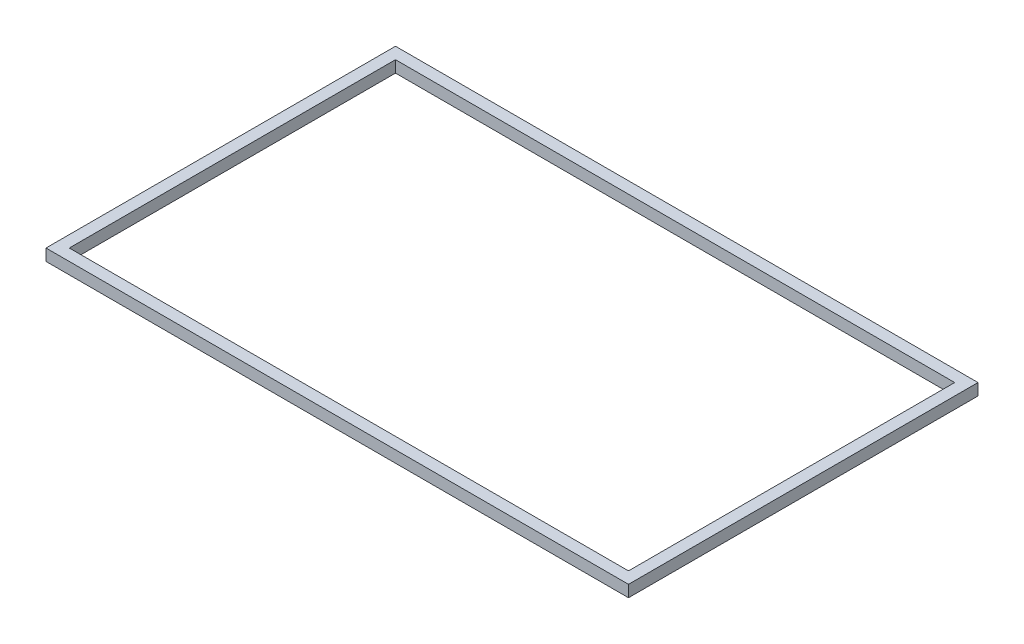
ISO-10303-21;
HEADER;
FILE_DESCRIPTION(('STEP AP214'),'2;1');
FILE_NAME('part.step','',(''),(''),'','','');
FILE_SCHEMA(('AUTOMOTIVE_DESIGN { 1 0 10303 214 1 1 1 1 }'));
ENDSEC;
DATA;
#1=APPLICATION_CONTEXT('core data for automotive mechanical design processes');
#2=APPLICATION_PROTOCOL_DEFINITION('international standard','automotive_design',2000,#1);
#3=PRODUCT_CONTEXT('',#1,'mechanical');
#4=PRODUCT('Part','Part','',(#3));
#5=PRODUCT_RELATED_PRODUCT_CATEGORY('part','',(#4));
#6=PRODUCT_DEFINITION_FORMATION('','',#4);
#7=PRODUCT_DEFINITION_CONTEXT('part definition',#1,'design');
#8=PRODUCT_DEFINITION('design','',#6,#7);
#9=PRODUCT_DEFINITION_SHAPE('','',#8);
#10=(LENGTH_UNIT() NAMED_UNIT(*) SI_UNIT(.MILLI.,.METRE.));
#11=(NAMED_UNIT(*) PLANE_ANGLE_UNIT() SI_UNIT($,.RADIAN.));
#12=(NAMED_UNIT(*) SI_UNIT($,.STERADIAN.) SOLID_ANGLE_UNIT());
#13=UNCERTAINTY_MEASURE_WITH_UNIT(LENGTH_MEASURE(1.E-05),#10,'distance_accuracy_value','');
#14=(GEOMETRIC_REPRESENTATION_CONTEXT(3) GLOBAL_UNCERTAINTY_ASSIGNED_CONTEXT((#13)) GLOBAL_UNIT_ASSIGNED_CONTEXT((#10,
#11,#12)) REPRESENTATION_CONTEXT('',''));
#15=CARTESIAN_POINT('',(0.,0.,0.));
#16=DIRECTION('',(0.,0.,1.));
#17=DIRECTION('',(1.,0.,0.));
#18=AXIS2_PLACEMENT_3D('',#15,#16,#17);
#19=CARTESIAN_POINT('',(0.,0.,0.));
#20=DIRECTION('',(0.,-1.,0.));
#21=DIRECTION('',(0.,0.,-1.));
#22=AXIS2_PLACEMENT_3D('',#19,#20,#21);
#23=PLANE('',#22);
#24=DIRECTION('',(1.,0.,0.));
#25=VECTOR('',#24,1.);
#26=CARTESIAN_POINT('',(5.00000000000001,0.,-5.));
#27=LINE('',#26,#25);
#28=CARTESIAN_POINT('',(5.00000000000001,0.,-5.));
#29=VERTEX_POINT('',#28);
#30=CARTESIAN_POINT('',(245.,0.,-5.));
#31=VERTEX_POINT('',#30);
#32=EDGE_CURVE('E111',#29,#31,#27,.T.);
#33=ORIENTED_EDGE('',*,*,#32,.T.);
#34=DIRECTION('',(0.,0.,-1.));
#35=VECTOR('',#34,1.);
#36=CARTESIAN_POINT('',(245.,0.,-81.4772910787425));
#37=LINE('',#36,#35);
#38=CARTESIAN_POINT('',(245.,0.,-145.));
#39=VERTEX_POINT('',#38);
#40=EDGE_CURVE('E58',#31,#39,#37,.T.);
#41=ORIENTED_EDGE('',*,*,#40,.T.);
#42=DIRECTION('',(-1.,0.,0.));
#43=VECTOR('',#42,1.);
#44=CARTESIAN_POINT('',(4.99999999999999,0.,-145.));
#45=LINE('',#44,#43);
#46=CARTESIAN_POINT('',(4.99999999999999,0.,-145.));
#47=VERTEX_POINT('',#46);
#48=EDGE_CURVE('E108',#39,#47,#45,.T.);
#49=ORIENTED_EDGE('',*,*,#48,.T.);
#50=DIRECTION('',(0.,0.,1.));
#51=VECTOR('',#50,1.);
#52=CARTESIAN_POINT('',(5.00000000000001,0.,-5.));
#53=LINE('',#52,#51);
#54=EDGE_CURVE('E102',#47,#29,#53,.T.);
#55=ORIENTED_EDGE('',*,*,#54,.T.);
#56=EDGE_LOOP('',(#33,#41,#49,#55));
#57=FACE_BOUND('',#56,.T.);
#58=DIRECTION('',(0.,0.,1.));
#59=VECTOR('',#58,1.);
#60=CARTESIAN_POINT('',(0.,0.,0.));
#61=LINE('',#60,#59);
#62=CARTESIAN_POINT('',(0.,0.,-150.));
#63=VERTEX_POINT('',#62);
#64=CARTESIAN_POINT('',(0.,0.,0.));
#65=VERTEX_POINT('',#64);
#66=EDGE_CURVE('E131',#63,#65,#61,.T.);
#67=ORIENTED_EDGE('',*,*,#66,.F.);
#68=DIRECTION('',(-1.,0.,0.));
#69=VECTOR('',#68,1.);
#70=CARTESIAN_POINT('',(0.,0.,-150.));
#71=LINE('',#70,#69);
#72=CARTESIAN_POINT('',(250.,0.,-150.));
#73=VERTEX_POINT('',#72);
#74=EDGE_CURVE('E140',#73,#63,#71,.T.);
#75=ORIENTED_EDGE('',*,*,#74,.F.);
#76=DIRECTION('',(0.,0.,-1.));
#77=VECTOR('',#76,1.);
#78=CARTESIAN_POINT('',(250.,0.,0.));
#79=LINE('',#78,#77);
#80=CARTESIAN_POINT('',(250.,0.,0.));
#81=VERTEX_POINT('',#80);
#82=EDGE_CURVE('E151',#81,#73,#79,.T.);
#83=ORIENTED_EDGE('',*,*,#82,.F.);
#84=DIRECTION('',(1.,0.,0.));
#85=VECTOR('',#84,1.);
#86=CARTESIAN_POINT('',(0.,0.,0.));
#87=LINE('',#86,#85);
#88=EDGE_CURVE('E149',#65,#81,#87,.T.);
#89=ORIENTED_EDGE('',*,*,#88,.F.);
#90=EDGE_LOOP('',(#67,#75,#83,#89));
#91=FACE_BOUND('',#90,.T.);
#92=ADVANCED_FACE('F35',(#57,#91),#23,.T.);
#93=CARTESIAN_POINT('',(0.,5.,0.));
#94=DIRECTION('',(0.,-1.,0.));
#95=DIRECTION('',(0.,0.,-1.));
#96=AXIS2_PLACEMENT_3D('',#93,#94,#95);
#97=PLANE('',#96);
#98=DIRECTION('',(-1.,0.,0.));
#99=VECTOR('',#98,1.);
#100=CARTESIAN_POINT('',(4.99999999999999,5.,-145.));
#101=LINE('',#100,#99);
#102=CARTESIAN_POINT('',(245.,5.,-145.));
#103=VERTEX_POINT('',#102);
#104=CARTESIAN_POINT('',(4.99999999999999,5.,-145.));
#105=VERTEX_POINT('',#104);
#106=EDGE_CURVE('E117',#103,#105,#101,.T.);
#107=ORIENTED_EDGE('',*,*,#106,.F.);
#108=DIRECTION('',(0.,0.,-1.));
#109=VECTOR('',#108,1.);
#110=CARTESIAN_POINT('',(245.,5.,-5.));
#111=LINE('',#110,#109);
#112=CARTESIAN_POINT('',(245.,5.,-5.));
#113=VERTEX_POINT('',#112);
#114=EDGE_CURVE('E120',#113,#103,#111,.T.);
#115=ORIENTED_EDGE('',*,*,#114,.F.);
#116=DIRECTION('',(1.,0.,0.));
#117=VECTOR('',#116,1.);
#118=CARTESIAN_POINT('',(5.00000000000001,5.,-5.));
#119=LINE('',#118,#117);
#120=CARTESIAN_POINT('',(5.00000000000001,5.,-5.));
#121=VERTEX_POINT('',#120);
#122=EDGE_CURVE('E126',#121,#113,#119,.T.);
#123=ORIENTED_EDGE('',*,*,#122,.F.);
#124=DIRECTION('',(0.,0.,1.));
#125=VECTOR('',#124,1.);
#126=CARTESIAN_POINT('',(5.00000000000001,5.,-5.));
#127=LINE('',#126,#125);
#128=EDGE_CURVE('E50',#105,#121,#127,.T.);
#129=ORIENTED_EDGE('',*,*,#128,.F.);
#130=EDGE_LOOP('',(#107,#115,#123,#129));
#131=FACE_BOUND('',#130,.T.);
#132=DIRECTION('',(0.,0.,1.));
#133=VECTOR('',#132,1.);
#134=CARTESIAN_POINT('',(0.,5.,0.));
#135=LINE('',#134,#133);
#136=CARTESIAN_POINT('',(0.,5.,-150.));
#137=VERTEX_POINT('',#136);
#138=CARTESIAN_POINT('',(0.,5.,0.));
#139=VERTEX_POINT('',#138);
#140=EDGE_CURVE('E136',#137,#139,#135,.T.);
#141=ORIENTED_EDGE('',*,*,#140,.T.);
#142=DIRECTION('',(1.,0.,0.));
#143=VECTOR('',#142,1.);
#144=CARTESIAN_POINT('',(0.,5.,0.));
#145=LINE('',#144,#143);
#146=CARTESIAN_POINT('',(250.,5.,0.));
#147=VERTEX_POINT('',#146);
#148=EDGE_CURVE('E139',#139,#147,#145,.T.);
#149=ORIENTED_EDGE('',*,*,#148,.T.);
#150=DIRECTION('',(0.,0.,-1.));
#151=VECTOR('',#150,1.);
#152=CARTESIAN_POINT('',(250.,5.,0.));
#153=LINE('',#152,#151);
#154=CARTESIAN_POINT('',(250.,5.,-150.));
#155=VERTEX_POINT('',#154);
#156=EDGE_CURVE('E142',#147,#155,#153,.T.);
#157=ORIENTED_EDGE('',*,*,#156,.T.);
#158=DIRECTION('',(-1.,0.,0.));
#159=VECTOR('',#158,1.);
#160=CARTESIAN_POINT('',(0.,5.,-150.));
#161=LINE('',#160,#159);
#162=EDGE_CURVE('E144',#155,#137,#161,.T.);
#163=ORIENTED_EDGE('',*,*,#162,.T.);
#164=EDGE_LOOP('',(#141,#149,#157,#163));
#165=FACE_BOUND('',#164,.T.);
#166=ADVANCED_FACE('F176',(#131,#165),#97,.F.);
#167=CARTESIAN_POINT('',(0.,5.,0.));
#168=DIRECTION('',(1.,0.,0.));
#169=DIRECTION('',(0.,0.,-1.));
#170=AXIS2_PLACEMENT_3D('',#167,#168,#169);
#171=PLANE('',#170);
#172=ORIENTED_EDGE('',*,*,#66,.T.);
#173=DIRECTION('',(0.,-1.,0.));
#174=VECTOR('',#173,1.);
#175=CARTESIAN_POINT('',(0.,5.,0.));
#176=LINE('',#175,#174);
#177=EDGE_CURVE('E11',#139,#65,#176,.T.);
#178=ORIENTED_EDGE('',*,*,#177,.F.);
#179=ORIENTED_EDGE('',*,*,#140,.F.);
#180=DIRECTION('',(0.,-1.,0.));
#181=VECTOR('',#180,1.);
#182=CARTESIAN_POINT('',(0.,5.,-150.));
#183=LINE('',#182,#181);
#184=EDGE_CURVE('E146',#137,#63,#183,.T.);
#185=ORIENTED_EDGE('',*,*,#184,.T.);
#186=EDGE_LOOP('',(#172,#178,#179,#185));
#187=FACE_BOUND('',#186,.T.);
#188=ADVANCED_FACE('F37',(#187),#171,.F.);
#189=CARTESIAN_POINT('',(0.,5.,0.));
#190=DIRECTION('',(0.,0.,-1.));
#191=DIRECTION('',(-1.,0.,0.));
#192=AXIS2_PLACEMENT_3D('',#189,#190,#191);
#193=PLANE('',#192);
#194=ORIENTED_EDGE('',*,*,#88,.T.);
#195=DIRECTION('',(0.,-1.,0.));
#196=VECTOR('',#195,1.);
#197=CARTESIAN_POINT('',(250.,5.,0.));
#198=LINE('',#197,#196);
#199=EDGE_CURVE('E43',#147,#81,#198,.T.);
#200=ORIENTED_EDGE('',*,*,#199,.F.);
#201=ORIENTED_EDGE('',*,*,#148,.F.);
#202=ORIENTED_EDGE('',*,*,#177,.T.);
#203=EDGE_LOOP('',(#194,#200,#201,#202));
#204=FACE_BOUND('',#203,.T.);
#205=ADVANCED_FACE('F177',(#204),#193,.F.);
#206=CARTESIAN_POINT('',(250.,5.,0.));
#207=DIRECTION('',(-1.,0.,0.));
#208=DIRECTION('',(0.,0.,1.));
#209=AXIS2_PLACEMENT_3D('',#206,#207,#208);
#210=PLANE('',#209);
#211=ORIENTED_EDGE('',*,*,#82,.T.);
#212=DIRECTION('',(0.,-1.,0.));
#213=VECTOR('',#212,1.);
#214=CARTESIAN_POINT('',(250.,5.,-150.));
#215=LINE('',#214,#213);
#216=EDGE_CURVE('E156',#155,#73,#215,.T.);
#217=ORIENTED_EDGE('',*,*,#216,.F.);
#218=ORIENTED_EDGE('',*,*,#156,.F.);
#219=ORIENTED_EDGE('',*,*,#199,.T.);
#220=EDGE_LOOP('',(#211,#217,#218,#219));
#221=FACE_BOUND('',#220,.T.);
#222=ADVANCED_FACE('F163',(#221),#210,.F.);
#223=CARTESIAN_POINT('',(0.,5.,-150.));
#224=DIRECTION('',(0.,0.,1.));
#225=DIRECTION('',(1.,0.,0.));
#226=AXIS2_PLACEMENT_3D('',#223,#224,#225);
#227=PLANE('',#226);
#228=ORIENTED_EDGE('',*,*,#74,.T.);
#229=ORIENTED_EDGE('',*,*,#184,.F.);
#230=ORIENTED_EDGE('',*,*,#162,.F.);
#231=ORIENTED_EDGE('',*,*,#216,.T.);
#232=EDGE_LOOP('',(#228,#229,#230,#231));
#233=FACE_BOUND('',#232,.T.);
#234=ADVANCED_FACE('F170',(#233),#227,.F.);
#235=CARTESIAN_POINT('',(5.00000000000001,0.,-5.));
#236=DIRECTION('',(-1.,0.,0.));
#237=DIRECTION('',(0.,0.,1.));
#238=AXIS2_PLACEMENT_3D('',#235,#236,#237);
#239=PLANE('',#238);
#240=ORIENTED_EDGE('',*,*,#128,.T.);
#241=DIRECTION('',(0.,1.,0.));
#242=VECTOR('',#241,1.);
#243=CARTESIAN_POINT('',(5.00000000000001,0.,-5.));
#244=LINE('',#243,#242);
#245=EDGE_CURVE('E98',#29,#121,#244,.T.);
#246=ORIENTED_EDGE('',*,*,#245,.F.);
#247=ORIENTED_EDGE('',*,*,#54,.F.);
#248=DIRECTION('',(0.,1.,0.));
#249=VECTOR('',#248,1.);
#250=CARTESIAN_POINT('',(4.99999999999999,0.,-145.));
#251=LINE('',#250,#249);
#252=EDGE_CURVE('E129',#47,#105,#251,.T.);
#253=ORIENTED_EDGE('',*,*,#252,.T.);
#254=EDGE_LOOP('',(#240,#246,#247,#253));
#255=FACE_BOUND('',#254,.T.);
#256=ADVANCED_FACE('F100',(#255),#239,.F.);
#257=CARTESIAN_POINT('',(4.99999999999999,0.,-145.));
#258=DIRECTION('',(0.,0.,-1.));
#259=DIRECTION('',(-1.,0.,0.));
#260=AXIS2_PLACEMENT_3D('',#257,#258,#259);
#261=PLANE('',#260);
#262=ORIENTED_EDGE('',*,*,#106,.T.);
#263=ORIENTED_EDGE('',*,*,#252,.F.);
#264=ORIENTED_EDGE('',*,*,#48,.F.);
#265=DIRECTION('',(0.,1.,0.));
#266=VECTOR('',#265,1.);
#267=CARTESIAN_POINT('',(245.,0.,-145.));
#268=LINE('',#267,#266);
#269=EDGE_CURVE('E132',#39,#103,#268,.T.);
#270=ORIENTED_EDGE('',*,*,#269,.T.);
#271=EDGE_LOOP('',(#262,#263,#264,#270));
#272=FACE_BOUND('',#271,.T.);
#273=ADVANCED_FACE('F197',(#272),#261,.F.);
#274=CARTESIAN_POINT('',(245.,0.,-81.4772910787425));
#275=DIRECTION('',(1.,0.,0.));
#276=DIRECTION('',(0.,0.,-1.));
#277=AXIS2_PLACEMENT_3D('',#274,#275,#276);
#278=PLANE('',#277);
#279=ORIENTED_EDGE('',*,*,#114,.T.);
#280=ORIENTED_EDGE('',*,*,#269,.F.);
#281=ORIENTED_EDGE('',*,*,#40,.F.);
#282=DIRECTION('',(0.,1.,0.));
#283=VECTOR('',#282,1.);
#284=CARTESIAN_POINT('',(245.,0.,-5.));
#285=LINE('',#284,#283);
#286=EDGE_CURVE('E107',#31,#113,#285,.T.);
#287=ORIENTED_EDGE('',*,*,#286,.T.);
#288=EDGE_LOOP('',(#279,#280,#281,#287));
#289=FACE_BOUND('',#288,.T.);
#290=ADVANCED_FACE('F201',(#289),#278,.F.);
#291=CARTESIAN_POINT('',(5.00000000000001,0.,-5.));
#292=DIRECTION('',(0.,0.,1.));
#293=DIRECTION('',(1.,0.,0.));
#294=AXIS2_PLACEMENT_3D('',#291,#292,#293);
#295=PLANE('',#294);
#296=ORIENTED_EDGE('',*,*,#122,.T.);
#297=ORIENTED_EDGE('',*,*,#286,.F.);
#298=ORIENTED_EDGE('',*,*,#32,.F.);
#299=ORIENTED_EDGE('',*,*,#245,.T.);
#300=EDGE_LOOP('',(#296,#297,#298,#299));
#301=FACE_BOUND('',#300,.T.);
#302=ADVANCED_FACE('F112',(#301),#295,.F.);
#303=CLOSED_SHELL('',(#92,#166,#188,#205,#222,#234,#256,#273,#290,#302));
#304=MANIFOLD_SOLID_BREP('B2',#303);
#305=ADVANCED_BREP_SHAPE_REPRESENTATION('',(#18,#304),#14);
#306=SHAPE_DEFINITION_REPRESENTATION(#9,#305);
ENDSEC;
END-ISO-10303-21;
